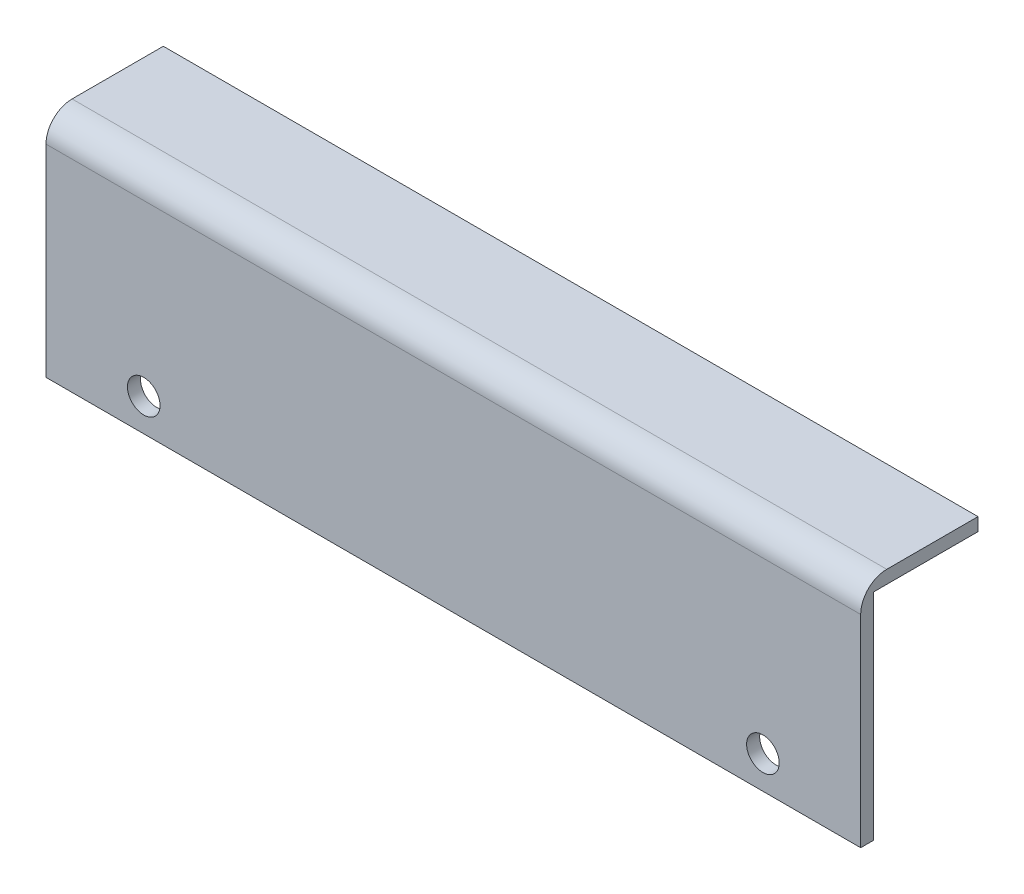
ISO-10303-21;
HEADER;
FILE_DESCRIPTION(('STEP AP214'),'2;1');
FILE_NAME('part.step','',(''),(''),'','','');
FILE_SCHEMA(('AUTOMOTIVE_DESIGN { 1 0 10303 214 1 1 1 1 }'));
ENDSEC;
DATA;
#1=APPLICATION_CONTEXT('core data for automotive mechanical design processes');
#2=APPLICATION_PROTOCOL_DEFINITION('international standard','automotive_design',2000,#1);
#3=PRODUCT_CONTEXT('',#1,'mechanical');
#4=PRODUCT('Part','Part','',(#3));
#5=PRODUCT_RELATED_PRODUCT_CATEGORY('part','',(#4));
#6=PRODUCT_DEFINITION_FORMATION('','',#4);
#7=PRODUCT_DEFINITION_CONTEXT('part definition',#1,'design');
#8=PRODUCT_DEFINITION('design','',#6,#7);
#9=PRODUCT_DEFINITION_SHAPE('','',#8);
#10=(LENGTH_UNIT() NAMED_UNIT(*) SI_UNIT(.MILLI.,.METRE.));
#11=(NAMED_UNIT(*) PLANE_ANGLE_UNIT() SI_UNIT($,.RADIAN.));
#12=(NAMED_UNIT(*) SI_UNIT($,.STERADIAN.) SOLID_ANGLE_UNIT());
#13=UNCERTAINTY_MEASURE_WITH_UNIT(LENGTH_MEASURE(1.E-05),#10,'distance_accuracy_value','');
#14=(GEOMETRIC_REPRESENTATION_CONTEXT(3) GLOBAL_UNCERTAINTY_ASSIGNED_CONTEXT((#13)) GLOBAL_UNIT_ASSIGNED_CONTEXT((#10,
#11,#12)) REPRESENTATION_CONTEXT('',''));
#15=CARTESIAN_POINT('',(0.,0.,0.));
#16=DIRECTION('',(0.,0.,1.));
#17=DIRECTION('',(1.,0.,0.));
#18=AXIS2_PLACEMENT_3D('',#15,#16,#17);
#19=CARTESIAN_POINT('',(125.,16.7867758305788,-1.14164631227231));
#20=DIRECTION('',(0.,0.,1.));
#21=DIRECTION('',(0.,-1.,0.));
#22=AXIS2_PLACEMENT_3D('',#19,#20,#21);
#23=PLANE('',#22);
#24=CARTESIAN_POINT('',(110.,-11.2132241694212,-1.14164631227231));
#25=DIRECTION('',(0.,0.,-1.));
#26=DIRECTION('',(0.,1.,0.));
#27=AXIS2_PLACEMENT_3D('',#24,#25,#26);
#28=CIRCLE('',#27,2.49999999999999);
#29=CARTESIAN_POINT('',(110.,-8.71322416942122,-1.14164631227231));
#30=VERTEX_POINT('',#29);
#31=EDGE_CURVE('E144',#30,#30,#28,.T.);
#32=ORIENTED_EDGE('',*,*,#31,.F.);
#33=EDGE_LOOP('',(#32));
#34=FACE_BOUND('',#33,.T.);
#35=CARTESIAN_POINT('',(15.,-11.2132241694212,-1.14164631227231));
#36=DIRECTION('',(0.,0.,-1.));
#37=DIRECTION('',(0.,1.,0.));
#38=AXIS2_PLACEMENT_3D('',#35,#36,#37);
#39=CIRCLE('',#38,2.5);
#40=CARTESIAN_POINT('',(15.,-8.71322416942121,-1.14164631227231));
#41=VERTEX_POINT('',#40);
#42=EDGE_CURVE('E152',#41,#41,#39,.T.);
#43=ORIENTED_EDGE('',*,*,#42,.F.);
#44=EDGE_LOOP('',(#43));
#45=FACE_BOUND('',#44,.T.);
#46=DIRECTION('',(0.,1.,0.));
#47=VECTOR('',#46,1.);
#48=CARTESIAN_POINT('',(0.,16.7867758305788,-1.14164631227231));
#49=LINE('',#48,#47);
#50=CARTESIAN_POINT('',(0.,-16.2132241694212,-1.14164631227231));
#51=VERTEX_POINT('',#50);
#52=CARTESIAN_POINT('',(0.,16.7867758305788,-1.14164631227231));
#53=VERTEX_POINT('',#52);
#54=EDGE_CURVE('E125',#51,#53,#49,.T.);
#55=ORIENTED_EDGE('',*,*,#54,.T.);
#56=DIRECTION('',(-1.,0.,0.));
#57=VECTOR('',#56,1.);
#58=CARTESIAN_POINT('',(125.,16.7867758305788,-1.14164631227231));
#59=LINE('',#58,#57);
#60=CARTESIAN_POINT('',(125.,16.7867758305788,-1.14164631227231));
#61=VERTEX_POINT('',#60);
#62=EDGE_CURVE('E104',#61,#53,#59,.T.);
#63=ORIENTED_EDGE('',*,*,#62,.F.);
#64=DIRECTION('',(0.,1.,0.));
#65=VECTOR('',#64,1.);
#66=CARTESIAN_POINT('',(125.,16.7867758305788,-1.14164631227231));
#67=LINE('',#66,#65);
#68=CARTESIAN_POINT('',(125.,-16.2132241694212,-1.14164631227231));
#69=VERTEX_POINT('',#68);
#70=EDGE_CURVE('E112',#69,#61,#67,.T.);
#71=ORIENTED_EDGE('',*,*,#70,.F.);
#72=DIRECTION('',(-1.,0.,0.));
#73=VECTOR('',#72,1.);
#74=CARTESIAN_POINT('',(125.,-16.2132241694212,-1.14164631227231));
#75=LINE('',#74,#73);
#76=EDGE_CURVE('E171',#69,#51,#75,.T.);
#77=ORIENTED_EDGE('',*,*,#76,.T.);
#78=EDGE_LOOP('',(#55,#63,#71,#77));
#79=FACE_BOUND('',#78,.T.);
#80=ADVANCED_FACE('F38',(#34,#45,#79),#23,.F.);
#81=CARTESIAN_POINT('',(125.,16.7867758305788,-1.14164631227231));
#82=DIRECTION('',(0.,1.,0.));
#83=DIRECTION('',(0.,0.,1.));
#84=AXIS2_PLACEMENT_3D('',#81,#82,#83);
#85=PLANE('',#84);
#86=DIRECTION('',(0.,0.,-1.));
#87=VECTOR('',#86,1.);
#88=CARTESIAN_POINT('',(0.,16.7867758305788,-1.14164631227231));
#89=LINE('',#88,#87);
#90=CARTESIAN_POINT('',(0.,16.7867758305788,-17.1416463122723));
#91=VERTEX_POINT('',#90);
#92=EDGE_CURVE('E174',#53,#91,#89,.T.);
#93=ORIENTED_EDGE('',*,*,#92,.T.);
#94=DIRECTION('',(-1.,0.,0.));
#95=VECTOR('',#94,1.);
#96=CARTESIAN_POINT('',(125.,16.7867758305788,-17.1416463122723));
#97=LINE('',#96,#95);
#98=CARTESIAN_POINT('',(125.,16.7867758305788,-17.1416463122723));
#99=VERTEX_POINT('',#98);
#100=EDGE_CURVE('E107',#99,#91,#97,.T.);
#101=ORIENTED_EDGE('',*,*,#100,.F.);
#102=DIRECTION('',(0.,0.,-1.));
#103=VECTOR('',#102,1.);
#104=CARTESIAN_POINT('',(125.,16.7867758305788,-1.14164631227231));
#105=LINE('',#104,#103);
#106=EDGE_CURVE('E100',#61,#99,#105,.T.);
#107=ORIENTED_EDGE('',*,*,#106,.F.);
#108=ORIENTED_EDGE('',*,*,#62,.T.);
#109=EDGE_LOOP('',(#93,#101,#107,#108));
#110=FACE_BOUND('',#109,.T.);
#111=ADVANCED_FACE('F102',(#110),#85,.F.);
#112=CARTESIAN_POINT('',(125.,18.7867758305788,-17.1416463122723));
#113=DIRECTION('',(0.,0.,1.));
#114=DIRECTION('',(1.,0.,0.));
#115=AXIS2_PLACEMENT_3D('',#112,#113,#114);
#116=PLANE('',#115);
#117=DIRECTION('',(0.,1.,0.));
#118=VECTOR('',#117,1.);
#119=CARTESIAN_POINT('',(0.,18.7867758305788,-17.1416463122723));
#120=LINE('',#119,#118);
#121=CARTESIAN_POINT('',(0.,18.7867758305788,-17.1416463122723));
#122=VERTEX_POINT('',#121);
#123=EDGE_CURVE('E177',#91,#122,#120,.T.);
#124=ORIENTED_EDGE('',*,*,#123,.T.);
#125=DIRECTION('',(-1.,0.,0.));
#126=VECTOR('',#125,1.);
#127=CARTESIAN_POINT('',(125.,18.7867758305788,-17.1416463122723));
#128=LINE('',#127,#126);
#129=CARTESIAN_POINT('',(125.,18.7867758305788,-17.1416463122723));
#130=VERTEX_POINT('',#129);
#131=EDGE_CURVE('E134',#130,#122,#128,.T.);
#132=ORIENTED_EDGE('',*,*,#131,.F.);
#133=DIRECTION('',(0.,1.,0.));
#134=VECTOR('',#133,1.);
#135=CARTESIAN_POINT('',(125.,18.7867758305788,-17.1416463122723));
#136=LINE('',#135,#134);
#137=EDGE_CURVE('E111',#99,#130,#136,.T.);
#138=ORIENTED_EDGE('',*,*,#137,.F.);
#139=ORIENTED_EDGE('',*,*,#100,.T.);
#140=EDGE_LOOP('',(#124,#132,#138,#139));
#141=FACE_BOUND('',#140,.T.);
#142=ADVANCED_FACE('F201',(#141),#116,.F.);
#143=CARTESIAN_POINT('',(125.,18.7867758305788,0.858353687727691));
#144=DIRECTION('',(0.,-1.,0.));
#145=DIRECTION('',(0.,0.,-1.));
#146=AXIS2_PLACEMENT_3D('',#143,#144,#145);
#147=PLANE('',#146);
#148=DIRECTION('',(0.,0.,1.));
#149=VECTOR('',#148,1.);
#150=CARTESIAN_POINT('',(0.,18.7867758305788,0.858353687727691));
#151=LINE('',#150,#149);
#152=CARTESIAN_POINT('',(0.,18.7867758305788,-3.14164631227231));
#153=VERTEX_POINT('',#152);
#154=EDGE_CURVE('E180',#122,#153,#151,.T.);
#155=ORIENTED_EDGE('',*,*,#154,.T.);
#156=DIRECTION('',(-1.,0.,0.));
#157=VECTOR('',#156,1.);
#158=CARTESIAN_POINT('',(125.,18.7867758305788,-3.14164631227231));
#159=LINE('',#158,#157);
#160=CARTESIAN_POINT('',(125.,18.7867758305788,-3.14164631227231));
#161=VERTEX_POINT('',#160);
#162=EDGE_CURVE('E48',#153,#161,#159,.F.);
#163=ORIENTED_EDGE('',*,*,#162,.T.);
#164=DIRECTION('',(0.,0.,1.));
#165=VECTOR('',#164,1.);
#166=CARTESIAN_POINT('',(125.,18.7867758305788,0.858353687727691));
#167=LINE('',#166,#165);
#168=EDGE_CURVE('E163',#130,#161,#167,.T.);
#169=ORIENTED_EDGE('',*,*,#168,.F.);
#170=ORIENTED_EDGE('',*,*,#131,.T.);
#171=EDGE_LOOP('',(#155,#163,#169,#170));
#172=FACE_BOUND('',#171,.T.);
#173=ADVANCED_FACE('F197',(#172),#147,.F.);
#174=CARTESIAN_POINT('',(125.,18.7867758305788,0.858353687727691));
#175=DIRECTION('',(0.,0.,-1.));
#176=DIRECTION('',(0.,1.,0.));
#177=AXIS2_PLACEMENT_3D('',#174,#175,#176);
#178=PLANE('',#177);
#179=CARTESIAN_POINT('',(110.,-11.2132241694212,0.858353687727686));
#180=DIRECTION('',(0.,0.,-1.));
#181=DIRECTION('',(0.,1.,0.));
#182=AXIS2_PLACEMENT_3D('',#179,#180,#181);
#183=CIRCLE('',#182,2.49999999999999);
#184=CARTESIAN_POINT('',(110.,-8.71322416942122,0.858353687727687));
#185=VERTEX_POINT('',#184);
#186=EDGE_CURVE('E42',#185,#185,#183,.T.);
#187=ORIENTED_EDGE('',*,*,#186,.T.);
#188=EDGE_LOOP('',(#187));
#189=FACE_BOUND('',#188,.T.);
#190=CARTESIAN_POINT('',(15.,-11.2132241694212,0.858353687727686));
#191=DIRECTION('',(0.,0.,-1.));
#192=DIRECTION('',(0.,1.,0.));
#193=AXIS2_PLACEMENT_3D('',#190,#191,#192);
#194=CIRCLE('',#193,2.5);
#195=CARTESIAN_POINT('',(15.,-8.71322416942121,0.858353687727687));
#196=VERTEX_POINT('',#195);
#197=EDGE_CURVE('E141',#196,#196,#194,.T.);
#198=ORIENTED_EDGE('',*,*,#197,.T.);
#199=EDGE_LOOP('',(#198));
#200=FACE_BOUND('',#199,.T.);
#201=DIRECTION('',(0.,-1.,0.));
#202=VECTOR('',#201,1.);
#203=CARTESIAN_POINT('',(125.,18.7867758305788,0.858353687727691));
#204=LINE('',#203,#202);
#205=CARTESIAN_POINT('',(125.,14.7867758305788,0.858353687727691));
#206=VERTEX_POINT('',#205);
#207=CARTESIAN_POINT('',(125.,-16.2132241694212,0.858353687727687));
#208=VERTEX_POINT('',#207);
#209=EDGE_CURVE('E166',#206,#208,#204,.T.);
#210=ORIENTED_EDGE('',*,*,#209,.F.);
#211=DIRECTION('',(-1.,0.,0.));
#212=VECTOR('',#211,1.);
#213=CARTESIAN_POINT('',(125.,14.7867758305788,0.858353687727691));
#214=LINE('',#213,#212);
#215=CARTESIAN_POINT('',(0.,14.7867758305788,0.858353687727691));
#216=VERTEX_POINT('',#215);
#217=EDGE_CURVE('E127',#206,#216,#214,.T.);
#218=ORIENTED_EDGE('',*,*,#217,.T.);
#219=DIRECTION('',(0.,-1.,0.));
#220=VECTOR('',#219,1.);
#221=CARTESIAN_POINT('',(0.,18.7867758305788,0.858353687727691));
#222=LINE('',#221,#220);
#223=CARTESIAN_POINT('',(0.,-16.2132241694212,0.858353687727687));
#224=VERTEX_POINT('',#223);
#225=EDGE_CURVE('E183',#216,#224,#222,.T.);
#226=ORIENTED_EDGE('',*,*,#225,.T.);
#227=DIRECTION('',(-1.,0.,0.));
#228=VECTOR('',#227,1.);
#229=CARTESIAN_POINT('',(125.,-16.2132241694212,0.858353687727687));
#230=LINE('',#229,#228);
#231=EDGE_CURVE('E190',#208,#224,#230,.T.);
#232=ORIENTED_EDGE('',*,*,#231,.F.);
#233=EDGE_LOOP('',(#210,#218,#226,#232));
#234=FACE_BOUND('',#233,.T.);
#235=ADVANCED_FACE('F207',(#189,#200,#234),#178,.F.);
#236=CARTESIAN_POINT('',(125.,-16.2132241694212,0.858353687727687));
#237=DIRECTION('',(0.,1.,0.));
#238=DIRECTION('',(0.,0.,1.));
#239=AXIS2_PLACEMENT_3D('',#236,#237,#238);
#240=PLANE('',#239);
#241=DIRECTION('',(0.,0.,-1.));
#242=VECTOR('',#241,1.);
#243=CARTESIAN_POINT('',(0.,-16.2132241694212,0.858353687727687));
#244=LINE('',#243,#242);
#245=EDGE_CURVE('E122',#224,#51,#244,.T.);
#246=ORIENTED_EDGE('',*,*,#245,.T.);
#247=ORIENTED_EDGE('',*,*,#76,.F.);
#248=DIRECTION('',(0.,0.,-1.));
#249=VECTOR('',#248,1.);
#250=CARTESIAN_POINT('',(125.,-16.2132241694212,0.858353687727687));
#251=LINE('',#250,#249);
#252=EDGE_CURVE('E117',#208,#69,#251,.T.);
#253=ORIENTED_EDGE('',*,*,#252,.F.);
#254=ORIENTED_EDGE('',*,*,#231,.T.);
#255=EDGE_LOOP('',(#246,#247,#253,#254));
#256=FACE_BOUND('',#255,.T.);
#257=ADVANCED_FACE('F211',(#256),#240,.F.);
#258=CARTESIAN_POINT('',(125.,0.,0.));
#259=DIRECTION('',(1.,0.,0.));
#260=DIRECTION('',(0.,0.,-1.));
#261=AXIS2_PLACEMENT_3D('',#258,#259,#260);
#262=PLANE('',#261);
#263=ORIENTED_EDGE('',*,*,#168,.T.);
#264=CARTESIAN_POINT('',(125.,14.7867758305788,-3.14164631227231));
#265=DIRECTION('',(1.,0.,0.));
#266=DIRECTION('',(0.,0.,-1.));
#267=AXIS2_PLACEMENT_3D('',#264,#265,#266);
#268=CIRCLE('',#267,4.);
#269=EDGE_CURVE('E11',#161,#206,#268,.T.);
#270=ORIENTED_EDGE('',*,*,#269,.T.);
#271=ORIENTED_EDGE('',*,*,#209,.T.);
#272=ORIENTED_EDGE('',*,*,#252,.T.);
#273=ORIENTED_EDGE('',*,*,#70,.T.);
#274=ORIENTED_EDGE('',*,*,#106,.T.);
#275=ORIENTED_EDGE('',*,*,#137,.T.);
#276=EDGE_LOOP('',(#263,#270,#271,#272,#273,#274,#275));
#277=FACE_BOUND('',#276,.T.);
#278=ADVANCED_FACE('F115',(#277),#262,.T.);
#279=CARTESIAN_POINT('',(0.,0.,0.));
#280=DIRECTION('',(1.,0.,0.));
#281=DIRECTION('',(0.,0.,-1.));
#282=AXIS2_PLACEMENT_3D('',#279,#280,#281);
#283=PLANE('',#282);
#284=ORIENTED_EDGE('',*,*,#225,.F.);
#285=CARTESIAN_POINT('',(0.,14.7867758305788,-3.14164631227231));
#286=DIRECTION('',(1.,0.,0.));
#287=DIRECTION('',(0.,0.,-1.));
#288=AXIS2_PLACEMENT_3D('',#285,#286,#287);
#289=CIRCLE('',#288,4.);
#290=EDGE_CURVE('E63',#216,#153,#289,.F.);
#291=ORIENTED_EDGE('',*,*,#290,.T.);
#292=ORIENTED_EDGE('',*,*,#154,.F.);
#293=ORIENTED_EDGE('',*,*,#123,.F.);
#294=ORIENTED_EDGE('',*,*,#92,.F.);
#295=ORIENTED_EDGE('',*,*,#54,.F.);
#296=ORIENTED_EDGE('',*,*,#245,.F.);
#297=EDGE_LOOP('',(#284,#291,#292,#293,#294,#295,#296));
#298=FACE_BOUND('',#297,.T.);
#299=ADVANCED_FACE('F200',(#298),#283,.F.);
#300=CARTESIAN_POINT('',(125.,14.7867758305788,-3.14164631227231));
#301=DIRECTION('',(-1.,0.,0.));
#302=DIRECTION('',(0.,0.,1.));
#303=AXIS2_PLACEMENT_3D('',#300,#301,#302);
#304=CYLINDRICAL_SURFACE('',#303,4.);
#305=ORIENTED_EDGE('',*,*,#269,.F.);
#306=ORIENTED_EDGE('',*,*,#162,.F.);
#307=ORIENTED_EDGE('',*,*,#290,.F.);
#308=ORIENTED_EDGE('',*,*,#217,.F.);
#309=EDGE_LOOP('',(#305,#306,#307,#308));
#310=FACE_BOUND('',#309,.T.);
#311=ADVANCED_FACE('F40',(#310),#304,.T.);
#312=CARTESIAN_POINT('',(15.,-11.2132241694212,123.858353687728));
#313=DIRECTION('',(0.,0.,-1.));
#314=DIRECTION('',(0.,1.,0.));
#315=AXIS2_PLACEMENT_3D('',#312,#313,#314);
#316=CYLINDRICAL_SURFACE('',#315,2.5);
#317=ORIENTED_EDGE('',*,*,#42,.T.);
#318=EDGE_LOOP('',(#317));
#319=FACE_BOUND('',#318,.T.);
#320=ORIENTED_EDGE('',*,*,#197,.F.);
#321=EDGE_LOOP('',(#320));
#322=FACE_BOUND('',#321,.T.);
#323=ADVANCED_FACE('F270',(#319,#322),#316,.F.);
#324=CARTESIAN_POINT('',(110.,-11.2132241694212,123.858353687728));
#325=DIRECTION('',(0.,0.,-1.));
#326=DIRECTION('',(0.,1.,0.));
#327=AXIS2_PLACEMENT_3D('',#324,#325,#326);
#328=CYLINDRICAL_SURFACE('',#327,2.49999999999999);
#329=ORIENTED_EDGE('',*,*,#31,.T.);
#330=EDGE_LOOP('',(#329));
#331=FACE_BOUND('',#330,.T.);
#332=ORIENTED_EDGE('',*,*,#186,.F.);
#333=EDGE_LOOP('',(#332));
#334=FACE_BOUND('',#333,.T.);
#335=ADVANCED_FACE('F277',(#331,#334),#328,.F.);
#336=CLOSED_SHELL('',(#80,#111,#142,#173,#235,#257,#278,#299,#311,#323,#335));
#337=MANIFOLD_SOLID_BREP('B2',#336);
#338=ADVANCED_BREP_SHAPE_REPRESENTATION('',(#18,#337),#14);
#339=SHAPE_DEFINITION_REPRESENTATION(#9,#338);
ENDSEC;
END-ISO-10303-21;
